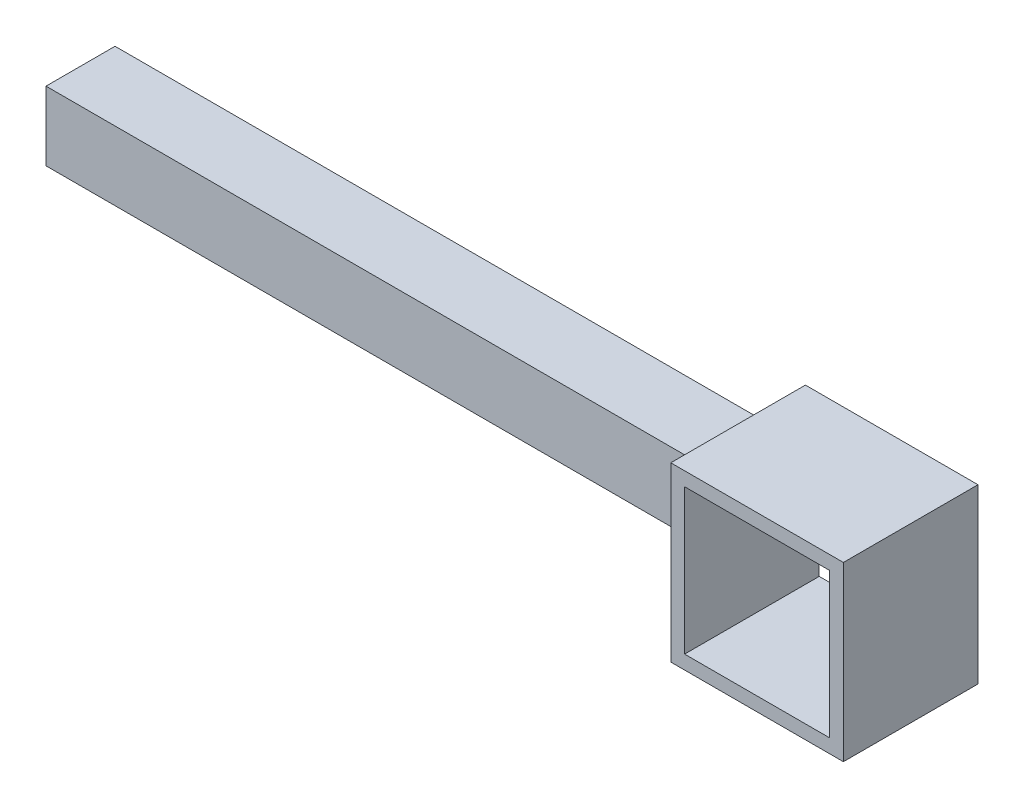
ISO-10303-21;
HEADER;
FILE_DESCRIPTION(('STEP AP214'),'2;1');
FILE_NAME('part.step','',(''),(''),'','','');
FILE_SCHEMA(('AUTOMOTIVE_DESIGN { 1 0 10303 214 1 1 1 1 }'));
ENDSEC;
DATA;
#1=APPLICATION_CONTEXT('core data for automotive mechanical design processes');
#2=APPLICATION_PROTOCOL_DEFINITION('international standard','automotive_design',2000,#1);
#3=PRODUCT_CONTEXT('',#1,'mechanical');
#4=PRODUCT('Part','Part','',(#3));
#5=PRODUCT_RELATED_PRODUCT_CATEGORY('part','',(#4));
#6=PRODUCT_DEFINITION_FORMATION('','',#4);
#7=PRODUCT_DEFINITION_CONTEXT('part definition',#1,'design');
#8=PRODUCT_DEFINITION('design','',#6,#7);
#9=PRODUCT_DEFINITION_SHAPE('','',#8);
#10=(LENGTH_UNIT() NAMED_UNIT(*) SI_UNIT(.MILLI.,.METRE.));
#11=(NAMED_UNIT(*) PLANE_ANGLE_UNIT() SI_UNIT($,.RADIAN.));
#12=(NAMED_UNIT(*) SI_UNIT($,.STERADIAN.) SOLID_ANGLE_UNIT());
#13=UNCERTAINTY_MEASURE_WITH_UNIT(LENGTH_MEASURE(1.E-05),#10,'distance_accuracy_value','');
#14=(GEOMETRIC_REPRESENTATION_CONTEXT(3) GLOBAL_UNCERTAINTY_ASSIGNED_CONTEXT((#13)) GLOBAL_UNIT_ASSIGNED_CONTEXT((#10,
#11,#12)) REPRESENTATION_CONTEXT('',''));
#15=CARTESIAN_POINT('',(0.,0.,0.));
#16=DIRECTION('',(0.,0.,1.));
#17=DIRECTION('',(1.,0.,0.));
#18=AXIS2_PLACEMENT_3D('',#15,#16,#17);
#19=CARTESIAN_POINT('',(0.,-20.,39.));
#20=DIRECTION('',(0.,1.,0.));
#21=DIRECTION('',(0.,0.,1.));
#22=AXIS2_PLACEMENT_3D('',#19,#20,#21);
#23=PLANE('',#22);
#24=DIRECTION('',(1.,0.,0.));
#25=VECTOR('',#24,1.);
#26=CARTESIAN_POINT('',(0.,-20.,20.));
#27=LINE('',#26,#25);
#28=CARTESIAN_POINT('',(0.,-20.,20.));
#29=VERTEX_POINT('',#28);
#30=CARTESIAN_POINT('',(200.,-20.,20.));
#31=VERTEX_POINT('',#30);
#32=EDGE_CURVE('E224',#29,#31,#27,.T.);
#33=ORIENTED_EDGE('',*,*,#32,.F.);
#34=DIRECTION('',(0.,0.,-1.));
#35=VECTOR('',#34,1.);
#36=CARTESIAN_POINT('',(0.,-20.,39.));
#37=LINE('',#36,#35);
#38=CARTESIAN_POINT('',(0.,-20.,0.));
#39=VERTEX_POINT('',#38);
#40=EDGE_CURVE('E151',#29,#39,#37,.T.);
#41=ORIENTED_EDGE('',*,*,#40,.T.);
#42=DIRECTION('',(1.,0.,0.));
#43=VECTOR('',#42,1.);
#44=CARTESIAN_POINT('',(0.,-20.,0.));
#45=LINE('',#44,#43);
#46=CARTESIAN_POINT('',(200.,-20.,0.));
#47=VERTEX_POINT('',#46);
#48=EDGE_CURVE('E155',#39,#47,#45,.T.);
#49=ORIENTED_EDGE('',*,*,#48,.T.);
#50=DIRECTION('',(0.,0.,-1.));
#51=VECTOR('',#50,1.);
#52=CARTESIAN_POINT('',(200.,-20.,39.));
#53=LINE('',#52,#51);
#54=EDGE_CURVE('E38',#31,#47,#53,.T.);
#55=ORIENTED_EDGE('',*,*,#54,.F.);
#56=EDGE_LOOP('',(#33,#41,#49,#55));
#57=FACE_BOUND('',#56,.T.);
#58=ADVANCED_FACE('F35',(#57),#23,.F.);
#59=CARTESIAN_POINT('',(0.,0.,39.));
#60=DIRECTION('',(0.,1.,0.));
#61=DIRECTION('',(0.,0.,1.));
#62=AXIS2_PLACEMENT_3D('',#59,#60,#61);
#63=PLANE('',#62);
#64=DIRECTION('',(0.,0.,-1.));
#65=VECTOR('',#64,1.);
#66=CARTESIAN_POINT('',(0.,0.,39.));
#67=LINE('',#66,#65);
#68=CARTESIAN_POINT('',(0.,0.,20.));
#69=VERTEX_POINT('',#68);
#70=CARTESIAN_POINT('',(0.,0.,0.));
#71=VERTEX_POINT('',#70);
#72=EDGE_CURVE('E191',#69,#71,#67,.T.);
#73=ORIENTED_EDGE('',*,*,#72,.F.);
#74=DIRECTION('',(-1.,0.,0.));
#75=VECTOR('',#74,1.);
#76=CARTESIAN_POINT('',(0.,0.,20.));
#77=LINE('',#76,#75);
#78=CARTESIAN_POINT('',(200.,0.,20.));
#79=VERTEX_POINT('',#78);
#80=EDGE_CURVE('E159',#79,#69,#77,.T.);
#81=ORIENTED_EDGE('',*,*,#80,.F.);
#82=DIRECTION('',(0.,0.,-1.));
#83=VECTOR('',#82,1.);
#84=CARTESIAN_POINT('',(200.,0.,39.));
#85=LINE('',#84,#83);
#86=CARTESIAN_POINT('',(200.,0.,0.));
#87=VERTEX_POINT('',#86);
#88=EDGE_CURVE('E193',#79,#87,#85,.T.);
#89=ORIENTED_EDGE('',*,*,#88,.T.);
#90=DIRECTION('',(1.,0.,0.));
#91=VECTOR('',#90,1.);
#92=CARTESIAN_POINT('',(0.,0.,0.));
#93=LINE('',#92,#91);
#94=EDGE_CURVE('E171',#71,#87,#93,.T.);
#95=ORIENTED_EDGE('',*,*,#94,.F.);
#96=EDGE_LOOP('',(#73,#81,#89,#95));
#97=FACE_BOUND('',#96,.T.);
#98=ADVANCED_FACE('F281',(#97),#63,.T.);
#99=CARTESIAN_POINT('',(0.,0.,39.));
#100=DIRECTION('',(1.,0.,0.));
#101=DIRECTION('',(0.,1.,0.));
#102=AXIS2_PLACEMENT_3D('',#99,#100,#101);
#103=PLANE('',#102);
#104=DIRECTION('',(0.,1.,0.));
#105=VECTOR('',#104,1.);
#106=CARTESIAN_POINT('',(0.,-5.,5.));
#107=LINE('',#106,#105);
#108=CARTESIAN_POINT('',(0.,-15.,5.));
#109=VERTEX_POINT('',#108);
#110=CARTESIAN_POINT('',(0.,-5.,5.));
#111=VERTEX_POINT('',#110);
#112=EDGE_CURVE('E458',#109,#111,#107,.T.);
#113=ORIENTED_EDGE('',*,*,#112,.F.);
#114=DIRECTION('',(0.,0.,-1.));
#115=VECTOR('',#114,1.);
#116=CARTESIAN_POINT('',(0.,-15.,5.));
#117=LINE('',#116,#115);
#118=CARTESIAN_POINT('',(0.,-15.,0.));
#119=VERTEX_POINT('',#118);
#120=EDGE_CURVE('E448',#109,#119,#117,.T.);
#121=ORIENTED_EDGE('',*,*,#120,.T.);
#122=DIRECTION('',(0.,-1.,0.));
#123=VECTOR('',#122,1.);
#124=CARTESIAN_POINT('',(0.,0.,0.));
#125=LINE('',#124,#123);
#126=EDGE_CURVE('E174',#119,#39,#125,.T.);
#127=ORIENTED_EDGE('',*,*,#126,.T.);
#128=ORIENTED_EDGE('',*,*,#40,.F.);
#129=DIRECTION('',(0.,-1.,0.));
#130=VECTOR('',#129,1.);
#131=CARTESIAN_POINT('',(0.,0.,20.));
#132=LINE('',#131,#130);
#133=EDGE_CURVE('E230',#69,#29,#132,.T.);
#134=ORIENTED_EDGE('',*,*,#133,.F.);
#135=ORIENTED_EDGE('',*,*,#72,.T.);
#136=CARTESIAN_POINT('',(0.,-5.,0.));
#137=VERTEX_POINT('',#136);
#138=EDGE_CURVE('E175',#71,#137,#125,.T.);
#139=ORIENTED_EDGE('',*,*,#138,.T.);
#140=DIRECTION('',(0.,0.,-1.));
#141=VECTOR('',#140,1.);
#142=CARTESIAN_POINT('',(0.,-5.,5.));
#143=LINE('',#142,#141);
#144=EDGE_CURVE('E51',#111,#137,#143,.T.);
#145=ORIENTED_EDGE('',*,*,#144,.F.);
#146=EDGE_LOOP('',(#113,#121,#127,#128,#134,#135,#139,#145));
#147=FACE_BOUND('',#146,.T.);
#148=ADVANCED_FACE('F228',(#147),#103,.F.);
#149=CARTESIAN_POINT('',(0.,11.0000000000001,39.));
#150=DIRECTION('',(0.,1.,0.));
#151=DIRECTION('',(0.,0.,1.));
#152=AXIS2_PLACEMENT_3D('',#149,#150,#151);
#153=PLANE('',#152);
#154=DIRECTION('',(1.,0.,0.));
#155=VECTOR('',#154,1.);
#156=CARTESIAN_POINT('',(0.,11.0000000000001,0.));
#157=LINE('',#156,#155);
#158=CARTESIAN_POINT('',(204.,11.0000000000001,0.));
#159=VERTEX_POINT('',#158);
#160=CARTESIAN_POINT('',(246.,11.0000000000001,0.));
#161=VERTEX_POINT('',#160);
#162=EDGE_CURVE('E178',#159,#161,#157,.T.);
#163=ORIENTED_EDGE('',*,*,#162,.T.);
#164=DIRECTION('',(0.,0.,-1.));
#165=VECTOR('',#164,1.);
#166=CARTESIAN_POINT('',(246.,11.0000000000001,39.));
#167=LINE('',#166,#165);
#168=CARTESIAN_POINT('',(246.,11.0000000000001,39.));
#169=VERTEX_POINT('',#168);
#170=EDGE_CURVE('E11',#169,#161,#167,.T.);
#171=ORIENTED_EDGE('',*,*,#170,.F.);
#172=DIRECTION('',(1.,0.,0.));
#173=VECTOR('',#172,1.);
#174=CARTESIAN_POINT('',(0.,11.0000000000001,39.));
#175=LINE('',#174,#173);
#176=CARTESIAN_POINT('',(204.,11.0000000000001,39.));
#177=VERTEX_POINT('',#176);
#178=EDGE_CURVE('E135',#177,#169,#175,.T.);
#179=ORIENTED_EDGE('',*,*,#178,.F.);
#180=DIRECTION('',(0.,0.,-1.));
#181=VECTOR('',#180,1.);
#182=CARTESIAN_POINT('',(204.,11.0000000000001,39.));
#183=LINE('',#182,#181);
#184=EDGE_CURVE('E60',#177,#159,#183,.T.);
#185=ORIENTED_EDGE('',*,*,#184,.T.);
#186=EDGE_LOOP('',(#163,#171,#179,#185));
#187=FACE_BOUND('',#186,.T.);
#188=ADVANCED_FACE('F289',(#187),#153,.F.);
#189=CARTESIAN_POINT('',(246.,0.,39.));
#190=DIRECTION('',(1.,0.,0.));
#191=DIRECTION('',(0.,0.,-1.));
#192=AXIS2_PLACEMENT_3D('',#189,#190,#191);
#193=PLANE('',#192);
#194=DIRECTION('',(0.,-1.,0.));
#195=VECTOR('',#194,1.);
#196=CARTESIAN_POINT('',(246.,0.,0.));
#197=LINE('',#196,#195);
#198=CARTESIAN_POINT('',(246.,-31.,0.));
#199=VERTEX_POINT('',#198);
#200=EDGE_CURVE('E141',#161,#199,#197,.T.);
#201=ORIENTED_EDGE('',*,*,#200,.T.);
#202=DIRECTION('',(0.,0.,-1.));
#203=VECTOR('',#202,1.);
#204=CARTESIAN_POINT('',(246.,-31.,39.));
#205=LINE('',#204,#203);
#206=CARTESIAN_POINT('',(246.,-31.,39.));
#207=VERTEX_POINT('',#206);
#208=EDGE_CURVE('E43',#207,#199,#205,.T.);
#209=ORIENTED_EDGE('',*,*,#208,.F.);
#210=DIRECTION('',(0.,-1.,0.));
#211=VECTOR('',#210,1.);
#212=CARTESIAN_POINT('',(246.,0.,39.));
#213=LINE('',#212,#211);
#214=EDGE_CURVE('E129',#169,#207,#213,.T.);
#215=ORIENTED_EDGE('',*,*,#214,.F.);
#216=ORIENTED_EDGE('',*,*,#170,.T.);
#217=EDGE_LOOP('',(#201,#209,#215,#216));
#218=FACE_BOUND('',#217,.T.);
#219=ADVANCED_FACE('F140',(#218),#193,.F.);
#220=CARTESIAN_POINT('',(0.,-31.,39.));
#221=DIRECTION('',(0.,1.,0.));
#222=DIRECTION('',(0.,0.,1.));
#223=AXIS2_PLACEMENT_3D('',#220,#221,#222);
#224=PLANE('',#223);
#225=DIRECTION('',(1.,0.,0.));
#226=VECTOR('',#225,1.);
#227=CARTESIAN_POINT('',(0.,-31.,0.));
#228=LINE('',#227,#226);
#229=CARTESIAN_POINT('',(204.,-31.,0.));
#230=VERTEX_POINT('',#229);
#231=EDGE_CURVE('E181',#230,#199,#228,.T.);
#232=ORIENTED_EDGE('',*,*,#231,.F.);
#233=DIRECTION('',(0.,0.,-1.));
#234=VECTOR('',#233,1.);
#235=CARTESIAN_POINT('',(204.,-31.,39.));
#236=LINE('',#235,#234);
#237=CARTESIAN_POINT('',(204.,-31.,39.));
#238=VERTEX_POINT('',#237);
#239=EDGE_CURVE('E145',#238,#230,#236,.T.);
#240=ORIENTED_EDGE('',*,*,#239,.F.);
#241=DIRECTION('',(1.,0.,0.));
#242=VECTOR('',#241,1.);
#243=CARTESIAN_POINT('',(0.,-31.,39.));
#244=LINE('',#243,#242);
#245=EDGE_CURVE('E134',#238,#207,#244,.T.);
#246=ORIENTED_EDGE('',*,*,#245,.T.);
#247=ORIENTED_EDGE('',*,*,#208,.T.);
#248=EDGE_LOOP('',(#232,#240,#246,#247));
#249=FACE_BOUND('',#248,.T.);
#250=ADVANCED_FACE('F147',(#249),#224,.T.);
#251=CARTESIAN_POINT('',(0.,-35.,39.));
#252=DIRECTION('',(0.,1.,0.));
#253=DIRECTION('',(0.,0.,1.));
#254=AXIS2_PLACEMENT_3D('',#251,#252,#253);
#255=PLANE('',#254);
#256=DIRECTION('',(1.,0.,0.));
#257=VECTOR('',#256,1.);
#258=CARTESIAN_POINT('',(0.,-35.,0.));
#259=LINE('',#258,#257);
#260=CARTESIAN_POINT('',(200.,-35.,0.));
#261=VERTEX_POINT('',#260);
#262=CARTESIAN_POINT('',(250.,-35.,0.));
#263=VERTEX_POINT('',#262);
#264=EDGE_CURVE('E161',#261,#263,#259,.T.);
#265=ORIENTED_EDGE('',*,*,#264,.T.);
#266=DIRECTION('',(0.,0.,-1.));
#267=VECTOR('',#266,1.);
#268=CARTESIAN_POINT('',(250.,-35.,39.));
#269=LINE('',#268,#267);
#270=CARTESIAN_POINT('',(250.,-35.,39.));
#271=VERTEX_POINT('',#270);
#272=EDGE_CURVE('E199',#271,#263,#269,.T.);
#273=ORIENTED_EDGE('',*,*,#272,.F.);
#274=DIRECTION('',(1.,0.,0.));
#275=VECTOR('',#274,1.);
#276=CARTESIAN_POINT('',(0.,-35.,39.));
#277=LINE('',#276,#275);
#278=CARTESIAN_POINT('',(200.,-35.,39.));
#279=VERTEX_POINT('',#278);
#280=EDGE_CURVE('E253',#279,#271,#277,.T.);
#281=ORIENTED_EDGE('',*,*,#280,.F.);
#282=DIRECTION('',(0.,0.,-1.));
#283=VECTOR('',#282,1.);
#284=CARTESIAN_POINT('',(200.,-35.,39.));
#285=LINE('',#284,#283);
#286=EDGE_CURVE('E200',#279,#261,#285,.T.);
#287=ORIENTED_EDGE('',*,*,#286,.T.);
#288=EDGE_LOOP('',(#265,#273,#281,#287));
#289=FACE_BOUND('',#288,.T.);
#290=ADVANCED_FACE('F272',(#289),#255,.F.);
#291=CARTESIAN_POINT('',(250.,0.,39.));
#292=DIRECTION('',(1.,0.,0.));
#293=DIRECTION('',(0.,0.,-1.));
#294=AXIS2_PLACEMENT_3D('',#291,#292,#293);
#295=PLANE('',#294);
#296=DIRECTION('',(0.,-1.,0.));
#297=VECTOR('',#296,1.);
#298=CARTESIAN_POINT('',(250.,0.,0.));
#299=LINE('',#298,#297);
#300=CARTESIAN_POINT('',(250.,15.,0.));
#301=VERTEX_POINT('',#300);
#302=EDGE_CURVE('E165',#301,#263,#299,.T.);
#303=ORIENTED_EDGE('',*,*,#302,.F.);
#304=DIRECTION('',(0.,0.,-1.));
#305=VECTOR('',#304,1.);
#306=CARTESIAN_POINT('',(250.,15.,39.));
#307=LINE('',#306,#305);
#308=CARTESIAN_POINT('',(250.,15.,39.));
#309=VERTEX_POINT('',#308);
#310=EDGE_CURVE('E197',#309,#301,#307,.T.);
#311=ORIENTED_EDGE('',*,*,#310,.F.);
#312=DIRECTION('',(0.,-1.,0.));
#313=VECTOR('',#312,1.);
#314=CARTESIAN_POINT('',(250.,0.,39.));
#315=LINE('',#314,#313);
#316=EDGE_CURVE('E255',#309,#271,#315,.T.);
#317=ORIENTED_EDGE('',*,*,#316,.T.);
#318=ORIENTED_EDGE('',*,*,#272,.T.);
#319=EDGE_LOOP('',(#303,#311,#317,#318));
#320=FACE_BOUND('',#319,.T.);
#321=ADVANCED_FACE('F268',(#320),#295,.T.);
#322=CARTESIAN_POINT('',(0.,15.,39.));
#323=DIRECTION('',(0.,1.,0.));
#324=DIRECTION('',(0.,0.,1.));
#325=AXIS2_PLACEMENT_3D('',#322,#323,#324);
#326=PLANE('',#325);
#327=DIRECTION('',(1.,0.,0.));
#328=VECTOR('',#327,1.);
#329=CARTESIAN_POINT('',(0.,15.,0.));
#330=LINE('',#329,#328);
#331=CARTESIAN_POINT('',(200.,15.,0.));
#332=VERTEX_POINT('',#331);
#333=EDGE_CURVE('E168',#332,#301,#330,.T.);
#334=ORIENTED_EDGE('',*,*,#333,.F.);
#335=DIRECTION('',(0.,0.,-1.));
#336=VECTOR('',#335,1.);
#337=CARTESIAN_POINT('',(200.,15.,39.));
#338=LINE('',#337,#336);
#339=CARTESIAN_POINT('',(200.,15.,39.));
#340=VERTEX_POINT('',#339);
#341=EDGE_CURVE('E195',#340,#332,#338,.T.);
#342=ORIENTED_EDGE('',*,*,#341,.F.);
#343=DIRECTION('',(1.,0.,0.));
#344=VECTOR('',#343,1.);
#345=CARTESIAN_POINT('',(0.,15.,39.));
#346=LINE('',#345,#344);
#347=EDGE_CURVE('E258',#340,#309,#346,.T.);
#348=ORIENTED_EDGE('',*,*,#347,.T.);
#349=ORIENTED_EDGE('',*,*,#310,.T.);
#350=EDGE_LOOP('',(#334,#342,#348,#349));
#351=FACE_BOUND('',#350,.T.);
#352=ADVANCED_FACE('F263',(#351),#326,.T.);
#353=CARTESIAN_POINT('',(200.,0.,39.));
#354=DIRECTION('',(1.,0.,0.));
#355=DIRECTION('',(0.,0.,-1.));
#356=AXIS2_PLACEMENT_3D('',#353,#354,#355);
#357=PLANE('',#356);
#358=DIRECTION('',(0.,-1.,0.));
#359=VECTOR('',#358,1.);
#360=CARTESIAN_POINT('',(200.,0.,0.));
#361=LINE('',#360,#359);
#362=EDGE_CURVE('E162',#332,#87,#361,.T.);
#363=ORIENTED_EDGE('',*,*,#362,.T.);
#364=ORIENTED_EDGE('',*,*,#88,.F.);
#365=DIRECTION('',(0.,1.,0.));
#366=VECTOR('',#365,1.);
#367=CARTESIAN_POINT('',(200.,0.,20.));
#368=LINE('',#367,#366);
#369=EDGE_CURVE('E214',#31,#79,#368,.T.);
#370=ORIENTED_EDGE('',*,*,#369,.F.);
#371=ORIENTED_EDGE('',*,*,#54,.T.);
#372=EDGE_CURVE('E158',#47,#261,#361,.T.);
#373=ORIENTED_EDGE('',*,*,#372,.T.);
#374=ORIENTED_EDGE('',*,*,#286,.F.);
#375=DIRECTION('',(0.,-1.,0.));
#376=VECTOR('',#375,1.);
#377=CARTESIAN_POINT('',(200.,0.,39.));
#378=LINE('',#377,#376);
#379=EDGE_CURVE('E112',#340,#279,#378,.T.);
#380=ORIENTED_EDGE('',*,*,#379,.F.);
#381=ORIENTED_EDGE('',*,*,#341,.T.);
#382=EDGE_LOOP('',(#363,#364,#370,#371,#373,#374,#380,#381));
#383=FACE_BOUND('',#382,.T.);
#384=ADVANCED_FACE('F210',(#383),#357,.F.);
#385=CARTESIAN_POINT('',(204.,0.,39.));
#386=DIRECTION('',(1.,0.,0.));
#387=DIRECTION('',(0.,0.,-1.));
#388=AXIS2_PLACEMENT_3D('',#385,#386,#387);
#389=PLANE('',#388);
#390=DIRECTION('',(0.,0.,-1.));
#391=VECTOR('',#390,1.);
#392=CARTESIAN_POINT('',(204.,-15.,5.));
#393=LINE('',#392,#391);
#394=CARTESIAN_POINT('',(204.,-15.,5.));
#395=VERTEX_POINT('',#394);
#396=CARTESIAN_POINT('',(204.,-15.,0.));
#397=VERTEX_POINT('',#396);
#398=EDGE_CURVE('E445',#395,#397,#393,.T.);
#399=ORIENTED_EDGE('',*,*,#398,.F.);
#400=DIRECTION('',(0.,-1.,0.));
#401=VECTOR('',#400,1.);
#402=CARTESIAN_POINT('',(204.,-5.,5.));
#403=LINE('',#402,#401);
#404=CARTESIAN_POINT('',(204.,-5.,5.));
#405=VERTEX_POINT('',#404);
#406=EDGE_CURVE('E441',#405,#395,#403,.T.);
#407=ORIENTED_EDGE('',*,*,#406,.F.);
#408=DIRECTION('',(0.,0.,-1.));
#409=VECTOR('',#408,1.);
#410=CARTESIAN_POINT('',(204.,-5.,5.));
#411=LINE('',#410,#409);
#412=CARTESIAN_POINT('',(204.,-5.,0.));
#413=VERTEX_POINT('',#412);
#414=EDGE_CURVE('E438',#405,#413,#411,.T.);
#415=ORIENTED_EDGE('',*,*,#414,.T.);
#416=DIRECTION('',(0.,-1.,0.));
#417=VECTOR('',#416,1.);
#418=CARTESIAN_POINT('',(204.,0.,0.));
#419=LINE('',#418,#417);
#420=EDGE_CURVE('E184',#159,#413,#419,.T.);
#421=ORIENTED_EDGE('',*,*,#420,.F.);
#422=ORIENTED_EDGE('',*,*,#184,.F.);
#423=DIRECTION('',(0.,-1.,0.));
#424=VECTOR('',#423,1.);
#425=CARTESIAN_POINT('',(204.,0.,39.));
#426=LINE('',#425,#424);
#427=EDGE_CURVE('E149',#177,#238,#426,.T.);
#428=ORIENTED_EDGE('',*,*,#427,.T.);
#429=ORIENTED_EDGE('',*,*,#239,.T.);
#430=EDGE_CURVE('E183',#397,#230,#419,.T.);
#431=ORIENTED_EDGE('',*,*,#430,.F.);
#432=EDGE_LOOP('',(#399,#407,#415,#421,#422,#428,#429,#431));
#433=FACE_BOUND('',#432,.T.);
#434=ADVANCED_FACE('F295',(#433),#389,.T.);
#435=CARTESIAN_POINT('',(0.,0.,39.));
#436=DIRECTION('',(0.,0.,1.));
#437=DIRECTION('',(1.,0.,0.));
#438=AXIS2_PLACEMENT_3D('',#435,#436,#437);
#439=PLANE('',#438);
#440=ORIENTED_EDGE('',*,*,#347,.F.);
#441=ORIENTED_EDGE('',*,*,#379,.T.);
#442=ORIENTED_EDGE('',*,*,#280,.T.);
#443=ORIENTED_EDGE('',*,*,#316,.F.);
#444=EDGE_LOOP('',(#440,#441,#442,#443));
#445=FACE_BOUND('',#444,.T.);
#446=ORIENTED_EDGE('',*,*,#178,.T.);
#447=ORIENTED_EDGE('',*,*,#214,.T.);
#448=ORIENTED_EDGE('',*,*,#245,.F.);
#449=ORIENTED_EDGE('',*,*,#427,.F.);
#450=EDGE_LOOP('',(#446,#447,#448,#449));
#451=FACE_BOUND('',#450,.T.);
#452=ADVANCED_FACE('F131',(#445,#451),#439,.T.);
#453=CARTESIAN_POINT('',(0.,0.,0.));
#454=DIRECTION('',(0.,0.,1.));
#455=DIRECTION('',(1.,0.,0.));
#456=AXIS2_PLACEMENT_3D('',#453,#454,#455);
#457=PLANE('',#456);
#458=ORIENTED_EDGE('',*,*,#126,.F.);
#459=DIRECTION('',(-1.,0.,0.));
#460=VECTOR('',#459,1.);
#461=CARTESIAN_POINT('',(0.,-15.,0.));
#462=LINE('',#461,#460);
#463=EDGE_CURVE('E455',#397,#119,#462,.T.);
#464=ORIENTED_EDGE('',*,*,#463,.F.);
#465=ORIENTED_EDGE('',*,*,#430,.T.);
#466=ORIENTED_EDGE('',*,*,#231,.T.);
#467=ORIENTED_EDGE('',*,*,#200,.F.);
#468=ORIENTED_EDGE('',*,*,#162,.F.);
#469=ORIENTED_EDGE('',*,*,#420,.T.);
#470=DIRECTION('',(1.,0.,0.));
#471=VECTOR('',#470,1.);
#472=CARTESIAN_POINT('',(0.,-5.,0.));
#473=LINE('',#472,#471);
#474=EDGE_CURVE('E459',#137,#413,#473,.T.);
#475=ORIENTED_EDGE('',*,*,#474,.F.);
#476=ORIENTED_EDGE('',*,*,#138,.F.);
#477=ORIENTED_EDGE('',*,*,#94,.T.);
#478=ORIENTED_EDGE('',*,*,#362,.F.);
#479=ORIENTED_EDGE('',*,*,#333,.T.);
#480=ORIENTED_EDGE('',*,*,#302,.T.);
#481=ORIENTED_EDGE('',*,*,#264,.F.);
#482=ORIENTED_EDGE('',*,*,#372,.F.);
#483=ORIENTED_EDGE('',*,*,#48,.F.);
#484=EDGE_LOOP('',(#458,#464,#465,#466,#467,#468,#469,#475,#476,#477,#478,#479,#480,#481,#482,#483));
#485=FACE_BOUND('',#484,.T.);
#486=ADVANCED_FACE('F221',(#485),#457,.F.);
#487=CARTESIAN_POINT('',(0.,0.,20.));
#488=DIRECTION('',(0.,0.,1.));
#489=DIRECTION('',(1.,0.,0.));
#490=AXIS2_PLACEMENT_3D('',#487,#488,#489);
#491=PLANE('',#490);
#492=ORIENTED_EDGE('',*,*,#133,.T.);
#493=ORIENTED_EDGE('',*,*,#32,.T.);
#494=ORIENTED_EDGE('',*,*,#369,.T.);
#495=ORIENTED_EDGE('',*,*,#80,.T.);
#496=EDGE_LOOP('',(#492,#493,#494,#495));
#497=FACE_BOUND('',#496,.T.);
#498=ADVANCED_FACE('F246',(#497),#491,.T.);
#499=CARTESIAN_POINT('',(0.,-15.,5.));
#500=DIRECTION('',(0.,-1.,0.));
#501=DIRECTION('',(1.,0.,0.));
#502=AXIS2_PLACEMENT_3D('',#499,#500,#501);
#503=PLANE('',#502);
#504=ORIENTED_EDGE('',*,*,#463,.T.);
#505=ORIENTED_EDGE('',*,*,#120,.F.);
#506=DIRECTION('',(-1.,0.,0.));
#507=VECTOR('',#506,1.);
#508=CARTESIAN_POINT('',(0.,-15.,5.));
#509=LINE('',#508,#507);
#510=EDGE_CURVE('E450',#395,#109,#509,.T.);
#511=ORIENTED_EDGE('',*,*,#510,.F.);
#512=ORIENTED_EDGE('',*,*,#398,.T.);
#513=EDGE_LOOP('',(#504,#505,#511,#512));
#514=FACE_BOUND('',#513,.T.);
#515=ADVANCED_FACE('F331',(#514),#503,.F.);
#516=CARTESIAN_POINT('',(0.,-5.,5.));
#517=DIRECTION('',(0.,1.,0.));
#518=DIRECTION('',(0.,0.,1.));
#519=AXIS2_PLACEMENT_3D('',#516,#517,#518);
#520=PLANE('',#519);
#521=ORIENTED_EDGE('',*,*,#474,.T.);
#522=ORIENTED_EDGE('',*,*,#414,.F.);
#523=DIRECTION('',(1.,0.,0.));
#524=VECTOR('',#523,1.);
#525=CARTESIAN_POINT('',(0.,-5.,5.));
#526=LINE('',#525,#524);
#527=EDGE_CURVE('E464',#111,#405,#526,.T.);
#528=ORIENTED_EDGE('',*,*,#527,.F.);
#529=ORIENTED_EDGE('',*,*,#144,.T.);
#530=EDGE_LOOP('',(#521,#522,#528,#529));
#531=FACE_BOUND('',#530,.T.);
#532=ADVANCED_FACE('F337',(#531),#520,.F.);
#533=CARTESIAN_POINT('',(0.,0.,5.));
#534=DIRECTION('',(0.,0.,1.));
#535=DIRECTION('',(1.,0.,0.));
#536=AXIS2_PLACEMENT_3D('',#533,#534,#535);
#537=PLANE('',#536);
#538=ORIENTED_EDGE('',*,*,#112,.T.);
#539=ORIENTED_EDGE('',*,*,#527,.T.);
#540=ORIENTED_EDGE('',*,*,#406,.T.);
#541=ORIENTED_EDGE('',*,*,#510,.T.);
#542=EDGE_LOOP('',(#538,#539,#540,#541));
#543=FACE_BOUND('',#542,.T.);
#544=ADVANCED_FACE('F345',(#543),#537,.F.);
#545=CLOSED_SHELL('',(#58,#98,#148,#188,#219,#250,#290,#321,#352,#384,#434,#452,#486,#498,#515,
#532,#544));
#546=MANIFOLD_SOLID_BREP('B2',#545);
#547=ADVANCED_BREP_SHAPE_REPRESENTATION('',(#18,#546),#14);
#548=SHAPE_DEFINITION_REPRESENTATION(#9,#547);
ENDSEC;
END-ISO-10303-21;
